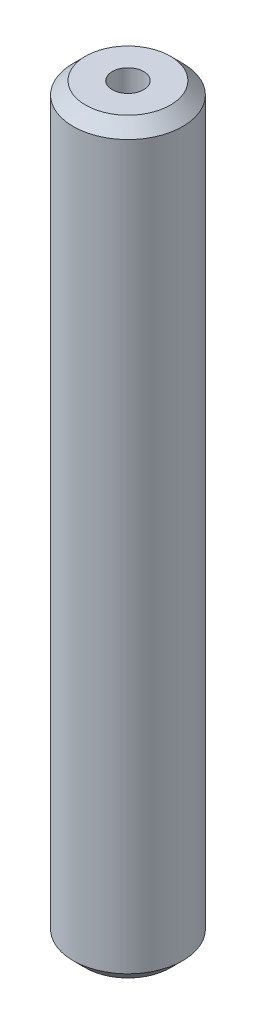
ISO-10303-21;
HEADER;
FILE_DESCRIPTION(('STEP AP214'),'2;1');
FILE_NAME('part.step','',(''),(''),'','','');
FILE_SCHEMA(('AUTOMOTIVE_DESIGN { 1 0 10303 214 1 1 1 1 }'));
ENDSEC;
DATA;
#1=APPLICATION_CONTEXT('core data for automotive mechanical design processes');
#2=APPLICATION_PROTOCOL_DEFINITION('international standard','automotive_design',2000,#1);
#3=PRODUCT_CONTEXT('',#1,'mechanical');
#4=PRODUCT('Part','Part','',(#3));
#5=PRODUCT_RELATED_PRODUCT_CATEGORY('part','',(#4));
#6=PRODUCT_DEFINITION_FORMATION('','',#4);
#7=PRODUCT_DEFINITION_CONTEXT('part definition',#1,'design');
#8=PRODUCT_DEFINITION('design','',#6,#7);
#9=PRODUCT_DEFINITION_SHAPE('','',#8);
#10=(LENGTH_UNIT() NAMED_UNIT(*) SI_UNIT(.MILLI.,.METRE.));
#11=(NAMED_UNIT(*) PLANE_ANGLE_UNIT() SI_UNIT($,.RADIAN.));
#12=(NAMED_UNIT(*) SI_UNIT($,.STERADIAN.) SOLID_ANGLE_UNIT());
#13=UNCERTAINTY_MEASURE_WITH_UNIT(LENGTH_MEASURE(1.E-05),#10,'distance_accuracy_value','');
#14=(GEOMETRIC_REPRESENTATION_CONTEXT(3) GLOBAL_UNCERTAINTY_ASSIGNED_CONTEXT((#13)) GLOBAL_UNIT_ASSIGNED_CONTEXT((#10,
#11,#12)) REPRESENTATION_CONTEXT('',''));
#15=CARTESIAN_POINT('',(0.,0.,0.));
#16=DIRECTION('',(0.,0.,1.));
#17=DIRECTION('',(1.,0.,0.));
#18=AXIS2_PLACEMENT_3D('',#15,#16,#17);
#19=CARTESIAN_POINT('',(0.,68.2226372404699,0.));
#20=DIRECTION('',(0.,-1.,0.));
#21=DIRECTION('',(0.,0.,-1.));
#22=AXIS2_PLACEMENT_3D('',#19,#20,#21);
#23=CYLINDRICAL_SURFACE('',#22,5.);
#24=CARTESIAN_POINT('',(0.,67.0941823944528,0.));
#25=DIRECTION('',(0.,1.,0.));
#26=DIRECTION('',(0.,0.,1.));
#27=AXIS2_PLACEMENT_3D('',#24,#25,#26);
#28=CIRCLE('',#27,5.);
#29=CARTESIAN_POINT('',(0.,67.0941823944528,5.));
#30=VERTEX_POINT('',#29);
#31=EDGE_CURVE('E50',#30,#30,#28,.F.);
#32=ORIENTED_EDGE('',*,*,#31,.T.);
#33=EDGE_LOOP('',(#32));
#34=FACE_BOUND('',#33,.T.);
#35=CARTESIAN_POINT('',(0.,1.12845484601701,0.));
#36=DIRECTION('',(0.,1.,0.));
#37=DIRECTION('',(0.,0.,1.));
#38=AXIS2_PLACEMENT_3D('',#35,#36,#37);
#39=CIRCLE('',#38,5.);
#40=CARTESIAN_POINT('',(0.,1.12845484601701,5.));
#41=VERTEX_POINT('',#40);
#42=EDGE_CURVE('E51',#41,#41,#39,.T.);
#43=ORIENTED_EDGE('',*,*,#42,.T.);
#44=EDGE_LOOP('',(#43));
#45=FACE_BOUND('',#44,.T.);
#46=ADVANCED_FACE('F39',(#34,#45),#23,.T.);
#47=CARTESIAN_POINT('',(0.,68.2226372404699,0.));
#48=DIRECTION('',(0.,1.,0.));
#49=DIRECTION('',(0.,0.,1.));
#50=AXIS2_PLACEMENT_3D('',#47,#48,#49);
#51=PLANE('',#50);
#52=CARTESIAN_POINT('',(0.,68.2226372404699,0.));
#53=DIRECTION('',(0.,1.,0.));
#54=DIRECTION('',(0.,0.,1.));
#55=AXIS2_PLACEMENT_3D('',#52,#53,#54);
#56=CIRCLE('',#55,3.87154515398298);
#57=CARTESIAN_POINT('',(0.,68.2226372404699,3.87154515398298));
#58=VERTEX_POINT('',#57);
#59=EDGE_CURVE('E54',#58,#58,#56,.T.);
#60=ORIENTED_EDGE('',*,*,#59,.T.);
#61=EDGE_LOOP('',(#60));
#62=FACE_BOUND('',#61,.T.);
#63=CARTESIAN_POINT('',(0.,68.2226372404699,0.));
#64=DIRECTION('',(0.,1.,0.));
#65=DIRECTION('',(0.,0.,1.));
#66=AXIS2_PLACEMENT_3D('',#63,#64,#65);
#67=CIRCLE('',#66,1.43710597919175);
#68=CARTESIAN_POINT('',(0.,68.2226372404699,1.43710597919175));
#69=VERTEX_POINT('',#68);
#70=EDGE_CURVE('E58',#69,#69,#67,.T.);
#71=ORIENTED_EDGE('',*,*,#70,.F.);
#72=EDGE_LOOP('',(#71));
#73=FACE_BOUND('',#72,.T.);
#74=ADVANCED_FACE('F69',(#62,#73),#51,.T.);
#75=CARTESIAN_POINT('',(0.,0.,0.));
#76=DIRECTION('',(0.,1.,0.));
#77=DIRECTION('',(0.,0.,1.));
#78=AXIS2_PLACEMENT_3D('',#75,#76,#77);
#79=PLANE('',#78);
#80=CARTESIAN_POINT('',(0.,0.,0.));
#81=DIRECTION('',(0.,1.,0.));
#82=DIRECTION('',(0.,0.,1.));
#83=AXIS2_PLACEMENT_3D('',#80,#81,#82);
#84=CIRCLE('',#83,3.87154515398298);
#85=CARTESIAN_POINT('',(0.,0.,3.87154515398298));
#86=VERTEX_POINT('',#85);
#87=EDGE_CURVE('E10',#86,#86,#84,.F.);
#88=ORIENTED_EDGE('',*,*,#87,.T.);
#89=EDGE_LOOP('',(#88));
#90=FACE_BOUND('',#89,.T.);
#91=CARTESIAN_POINT('',(0.,0.,0.));
#92=DIRECTION('',(0.,1.,0.));
#93=DIRECTION('',(0.,0.,1.));
#94=AXIS2_PLACEMENT_3D('',#91,#92,#93);
#95=CIRCLE('',#94,1.43710597919175);
#96=CARTESIAN_POINT('',(0.,0.,1.43710597919175));
#97=VERTEX_POINT('',#96);
#98=EDGE_CURVE('E63',#97,#97,#95,.T.);
#99=ORIENTED_EDGE('',*,*,#98,.T.);
#100=EDGE_LOOP('',(#99));
#101=FACE_BOUND('',#100,.T.);
#102=ADVANCED_FACE('F75',(#90,#101),#79,.F.);
#103=CARTESIAN_POINT('',(0.,68.2226372404699,0.));
#104=DIRECTION('',(0.,-1.,0.));
#105=DIRECTION('',(0.,0.,-1.));
#106=AXIS2_PLACEMENT_3D('',#103,#104,#105);
#107=CYLINDRICAL_SURFACE('',#106,1.43710597919175);
#108=ORIENTED_EDGE('',*,*,#70,.T.);
#109=EDGE_LOOP('',(#108));
#110=FACE_BOUND('',#109,.T.);
#111=ORIENTED_EDGE('',*,*,#98,.F.);
#112=EDGE_LOOP('',(#111));
#113=FACE_BOUND('',#112,.T.);
#114=ADVANCED_FACE('F70',(#110,#113),#107,.F.);
#115=CARTESIAN_POINT('',(0.,68.2226372404699,0.));
#116=DIRECTION('',(0.,-1.,0.));
#117=DIRECTION('',(0.,0.,-1.));
#118=AXIS2_PLACEMENT_3D('',#115,#116,#117);
#119=CONICAL_SURFACE('',#118,3.87154515398298,0.785398163397443);
#120=ORIENTED_EDGE('',*,*,#31,.F.);
#121=EDGE_LOOP('',(#120));
#122=FACE_BOUND('',#121,.T.);
#123=ORIENTED_EDGE('',*,*,#59,.F.);
#124=EDGE_LOOP('',(#123));
#125=FACE_BOUND('',#124,.T.);
#126=ADVANCED_FACE('F81',(#122,#125),#119,.T.);
#127=CARTESIAN_POINT('',(0.,1.12845484601701,0.));
#128=DIRECTION('',(0.,1.,0.));
#129=DIRECTION('',(0.,0.,1.));
#130=AXIS2_PLACEMENT_3D('',#127,#128,#129);
#131=CONICAL_SURFACE('',#130,5.,0.785398163397456);
#132=ORIENTED_EDGE('',*,*,#87,.F.);
#133=EDGE_LOOP('',(#132));
#134=FACE_BOUND('',#133,.T.);
#135=ORIENTED_EDGE('',*,*,#42,.F.);
#136=EDGE_LOOP('',(#135));
#137=FACE_BOUND('',#136,.T.);
#138=ADVANCED_FACE('F45',(#134,#137),#131,.T.);
#139=CLOSED_SHELL('',(#46,#74,#102,#114,#126,#138));
#140=MANIFOLD_SOLID_BREP('B2',#139);
#141=ADVANCED_BREP_SHAPE_REPRESENTATION('',(#18,#140),#14);
#142=SHAPE_DEFINITION_REPRESENTATION(#9,#141);
ENDSEC;
END-ISO-10303-21;
